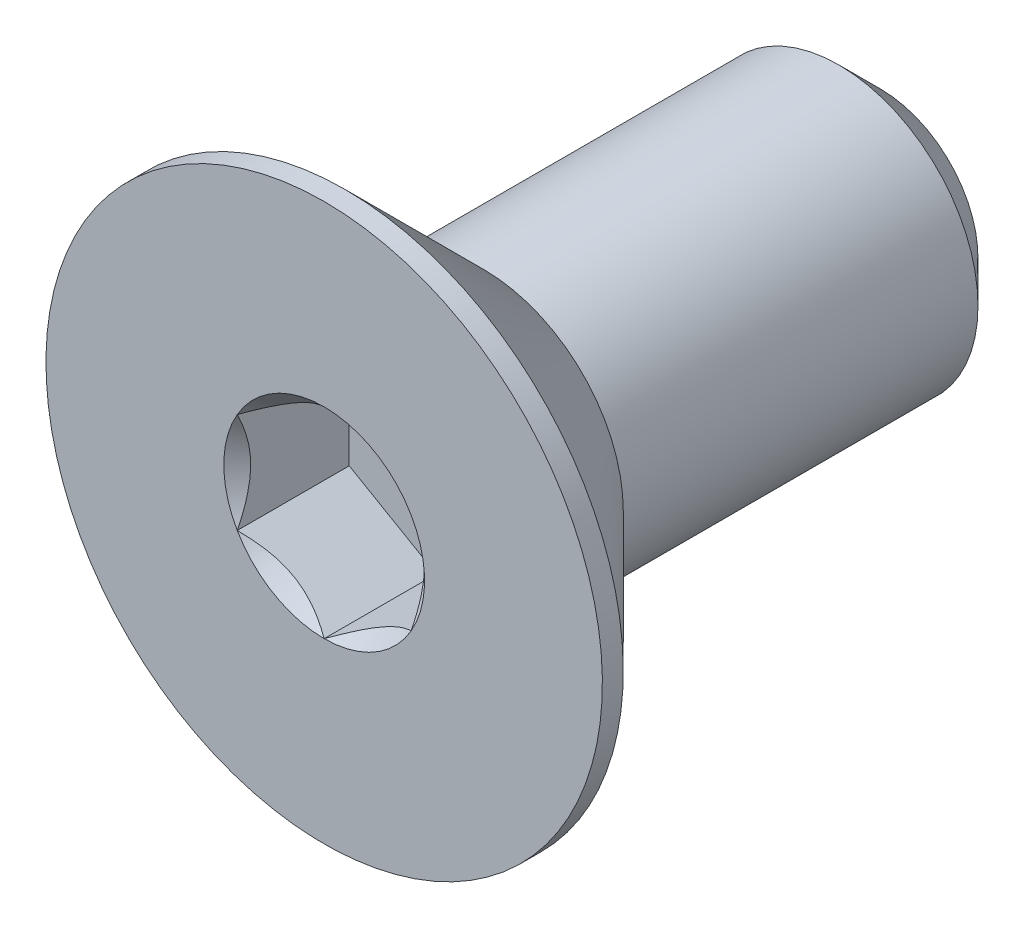
ISO-10303-21;
HEADER;
FILE_DESCRIPTION(('STEP AP214'),'2;1');
FILE_NAME('part.step','',(''),(''),'','','');
FILE_SCHEMA(('AUTOMOTIVE_DESIGN { 1 0 10303 214 1 1 1 1 }'));
ENDSEC;
DATA;
#1=APPLICATION_CONTEXT('core data for automotive mechanical design processes');
#2=APPLICATION_PROTOCOL_DEFINITION('international standard','automotive_design',2000,#1);
#3=PRODUCT_CONTEXT('',#1,'mechanical');
#4=PRODUCT('Part','Part','',(#3));
#5=PRODUCT_RELATED_PRODUCT_CATEGORY('part','',(#4));
#6=PRODUCT_DEFINITION_FORMATION('','',#4);
#7=PRODUCT_DEFINITION_CONTEXT('part definition',#1,'design');
#8=PRODUCT_DEFINITION('design','',#6,#7);
#9=PRODUCT_DEFINITION_SHAPE('','',#8);
#10=(LENGTH_UNIT() NAMED_UNIT(*) SI_UNIT(.MILLI.,.METRE.));
#11=(NAMED_UNIT(*) PLANE_ANGLE_UNIT() SI_UNIT($,.RADIAN.));
#12=(NAMED_UNIT(*) SI_UNIT($,.STERADIAN.) SOLID_ANGLE_UNIT());
#13=UNCERTAINTY_MEASURE_WITH_UNIT(LENGTH_MEASURE(1.E-05),#10,'distance_accuracy_value','');
#14=(GEOMETRIC_REPRESENTATION_CONTEXT(3) GLOBAL_UNCERTAINTY_ASSIGNED_CONTEXT((#13)) GLOBAL_UNIT_ASSIGNED_CONTEXT((#10,
#11,#12)) REPRESENTATION_CONTEXT('',''));
#15=CARTESIAN_POINT('',(0.,0.,0.));
#16=DIRECTION('',(0.,0.,1.));
#17=DIRECTION('',(1.,0.,0.));
#18=AXIS2_PLACEMENT_3D('',#15,#16,#17);
#19=CARTESIAN_POINT('',(0.,0.,-4.));
#20=DIRECTION('',(0.,0.,-1.));
#21=DIRECTION('',(0.,1.,0.));
#22=AXIS2_PLACEMENT_3D('',#19,#20,#21);
#23=CYLINDRICAL_SURFACE('',#22,2.);
#24=CARTESIAN_POINT('',(0.,0.,1.7));
#25=DIRECTION('',(0.,0.,-1.));
#26=DIRECTION('',(0.,1.,0.));
#27=AXIS2_PLACEMENT_3D('',#24,#25,#26);
#28=CIRCLE('',#27,2.);
#29=CARTESIAN_POINT('',(0.,2.,1.7));
#30=VERTEX_POINT('',#29);
#31=EDGE_CURVE('E11',#30,#30,#28,.F.);
#32=ORIENTED_EDGE('',*,*,#31,.F.);
#33=EDGE_LOOP('',(#32));
#34=FACE_BOUND('',#33,.T.);
#35=CARTESIAN_POINT('',(0.,0.,-3.4));
#36=DIRECTION('',(0.,0.,-1.));
#37=DIRECTION('',(0.,1.,0.));
#38=AXIS2_PLACEMENT_3D('',#35,#36,#37);
#39=CIRCLE('',#38,2.);
#40=CARTESIAN_POINT('',(0.,2.,-3.4));
#41=VERTEX_POINT('',#40);
#42=EDGE_CURVE('E43',#41,#41,#39,.F.);
#43=ORIENTED_EDGE('',*,*,#42,.T.);
#44=EDGE_LOOP('',(#43));
#45=FACE_BOUND('',#44,.T.);
#46=ADVANCED_FACE('F35',(#34,#45),#23,.T.);
#47=CARTESIAN_POINT('',(0.,2.,-4.));
#48=DIRECTION('',(0.,0.,-1.));
#49=DIRECTION('',(0.,1.,0.));
#50=AXIS2_PLACEMENT_3D('',#47,#48,#49);
#51=PLANE('',#50);
#52=CARTESIAN_POINT('',(0.,0.,-4.));
#53=DIRECTION('',(0.,0.,-1.));
#54=DIRECTION('',(0.,1.,0.));
#55=AXIS2_PLACEMENT_3D('',#52,#53,#54);
#56=CIRCLE('',#55,1.4);
#57=CARTESIAN_POINT('',(0.,1.4,-4.));
#58=VERTEX_POINT('',#57);
#59=EDGE_CURVE('E147',#58,#58,#56,.T.);
#60=ORIENTED_EDGE('',*,*,#59,.T.);
#61=EDGE_LOOP('',(#60));
#62=FACE_BOUND('',#61,.T.);
#63=ADVANCED_FACE('F156',(#62),#51,.T.);
#64=CARTESIAN_POINT('',(0.,0.,-4.));
#65=DIRECTION('',(0.,0.,1.));
#66=DIRECTION('',(0.,-1.,0.));
#67=AXIS2_PLACEMENT_3D('',#64,#65,#66);
#68=CONICAL_SURFACE('',#67,1.4,0.785398163397446);
#69=ORIENTED_EDGE('',*,*,#42,.F.);
#70=EDGE_LOOP('',(#69));
#71=FACE_BOUND('',#70,.T.);
#72=ORIENTED_EDGE('',*,*,#59,.F.);
#73=EDGE_LOOP('',(#72));
#74=FACE_BOUND('',#73,.T.);
#75=ADVANCED_FACE('F37',(#71,#74),#68,.T.);
#76=CARTESIAN_POINT('',(0.,0.,-4.));
#77=DIRECTION('',(0.,0.,-1.));
#78=DIRECTION('',(0.,1.,0.));
#79=AXIS2_PLACEMENT_3D('',#76,#77,#78);
#80=CYLINDRICAL_SURFACE('',#79,4.);
#81=CARTESIAN_POINT('',(0.,0.,4.));
#82=DIRECTION('',(0.,0.,-1.));
#83=DIRECTION('',(0.,1.,0.));
#84=AXIS2_PLACEMENT_3D('',#81,#82,#83);
#85=CIRCLE('',#84,4.);
#86=CARTESIAN_POINT('',(0.,4.,4.));
#87=VERTEX_POINT('',#86);
#88=EDGE_CURVE('E127',#87,#87,#85,.T.);
#89=ORIENTED_EDGE('',*,*,#88,.T.);
#90=EDGE_LOOP('',(#89));
#91=FACE_BOUND('',#90,.T.);
#92=CARTESIAN_POINT('',(0.,0.,3.69999999999999));
#93=DIRECTION('',(0.,0.,-1.));
#94=DIRECTION('',(0.,1.,0.));
#95=AXIS2_PLACEMENT_3D('',#92,#93,#94);
#96=CIRCLE('',#95,4.);
#97=CARTESIAN_POINT('',(0.,4.,3.69999999999999));
#98=VERTEX_POINT('',#97);
#99=EDGE_CURVE('E124',#98,#98,#96,.T.);
#100=ORIENTED_EDGE('',*,*,#99,.F.);
#101=EDGE_LOOP('',(#100));
#102=FACE_BOUND('',#101,.T.);
#103=ADVANCED_FACE('F155',(#91,#102),#80,.T.);
#104=CARTESIAN_POINT('',(0.,0.,1.7));
#105=DIRECTION('',(0.,0.,1.));
#106=DIRECTION('',(0.,-1.,0.));
#107=AXIS2_PLACEMENT_3D('',#104,#105,#106);
#108=CONICAL_SURFACE('',#107,2.,0.78539816339745);
#109=ORIENTED_EDGE('',*,*,#99,.T.);
#110=EDGE_LOOP('',(#109));
#111=FACE_BOUND('',#110,.T.);
#112=ORIENTED_EDGE('',*,*,#31,.T.);
#113=EDGE_LOOP('',(#112));
#114=FACE_BOUND('',#113,.T.);
#115=ADVANCED_FACE('F169',(#111,#114),#108,.T.);
#116=CARTESIAN_POINT('',(0.,0.,4.));
#117=DIRECTION('',(0.,0.,1.));
#118=DIRECTION('',(0.,-1.,0.));
#119=AXIS2_PLACEMENT_3D('',#116,#117,#118);
#120=PLANE('',#119);
#121=CARTESIAN_POINT('',(0.,0.,4.));
#122=DIRECTION('',(0.,0.,1.));
#123=DIRECTION('',(1.,0.,0.));
#124=AXIS2_PLACEMENT_3D('',#121,#122,#123);
#125=CIRCLE('',#124,1.44337567297406);
#126=CARTESIAN_POINT('',(1.25,0.721687836487038,4.));
#127=VERTEX_POINT('',#126);
#128=CARTESIAN_POINT('',(0.,1.44337567297407,4.));
#129=VERTEX_POINT('',#128);
#130=EDGE_CURVE('E94',#127,#129,#125,.T.);
#131=ORIENTED_EDGE('',*,*,#130,.F.);
#132=CARTESIAN_POINT('',(0.,0.,4.));
#133=DIRECTION('',(0.,0.,1.));
#134=DIRECTION('',(1.,0.,0.));
#135=AXIS2_PLACEMENT_3D('',#132,#133,#134);
#136=CIRCLE('',#135,1.44337567297406);
#137=CARTESIAN_POINT('',(1.24999999999999,-0.721687836487039,4.));
#138=VERTEX_POINT('',#137);
#139=EDGE_CURVE('E106',#138,#127,#136,.T.);
#140=ORIENTED_EDGE('',*,*,#139,.F.);
#141=CARTESIAN_POINT('',(0.,0.,4.));
#142=DIRECTION('',(0.,0.,1.));
#143=DIRECTION('',(1.,0.,0.));
#144=AXIS2_PLACEMENT_3D('',#141,#142,#143);
#145=CIRCLE('',#144,1.44337567297406);
#146=CARTESIAN_POINT('',(0.,-1.44337567297405,4.));
#147=VERTEX_POINT('',#146);
#148=EDGE_CURVE('E240',#147,#138,#145,.T.);
#149=ORIENTED_EDGE('',*,*,#148,.F.);
#150=CARTESIAN_POINT('',(0.,0.,4.));
#151=DIRECTION('',(0.,0.,1.));
#152=DIRECTION('',(1.,0.,0.));
#153=AXIS2_PLACEMENT_3D('',#150,#151,#152);
#154=CIRCLE('',#153,1.44337567297406);
#155=CARTESIAN_POINT('',(-1.25,-0.72168783648702,4.));
#156=VERTEX_POINT('',#155);
#157=EDGE_CURVE('E119',#156,#147,#154,.T.);
#158=ORIENTED_EDGE('',*,*,#157,.F.);
#159=CARTESIAN_POINT('',(0.,0.,4.));
#160=DIRECTION('',(0.,0.,1.));
#161=DIRECTION('',(1.,0.,0.));
#162=AXIS2_PLACEMENT_3D('',#159,#160,#161);
#163=CIRCLE('',#162,1.44337567297406);
#164=CARTESIAN_POINT('',(-1.25,0.72168783648703,4.));
#165=VERTEX_POINT('',#164);
#166=EDGE_CURVE('E241',#165,#156,#163,.T.);
#167=ORIENTED_EDGE('',*,*,#166,.F.);
#168=CARTESIAN_POINT('',(0.,0.,4.));
#169=DIRECTION('',(0.,0.,1.));
#170=DIRECTION('',(1.,0.,0.));
#171=AXIS2_PLACEMENT_3D('',#168,#169,#170);
#172=CIRCLE('',#171,1.44337567297406);
#173=EDGE_CURVE('E109',#129,#165,#172,.T.);
#174=ORIENTED_EDGE('',*,*,#173,.F.);
#175=EDGE_LOOP('',(#131,#140,#149,#158,#167,#174));
#176=FACE_BOUND('',#175,.T.);
#177=ORIENTED_EDGE('',*,*,#88,.F.);
#178=EDGE_LOOP('',(#177));
#179=FACE_BOUND('',#178,.T.);
#180=ADVANCED_FACE('F103',(#176,#179),#120,.T.);
#181=CARTESIAN_POINT('',(1.25,0.721687836487033,2.39));
#182=DIRECTION('',(0.5,0.866025403784439,0.));
#183=DIRECTION('',(-0.866025403784439,0.5,0.));
#184=AXIS2_PLACEMENT_3D('',#181,#182,#183);
#185=PLANE('',#184);
#186=DIRECTION('',(0.,0.,1.));
#187=VECTOR('',#186,1.);
#188=CARTESIAN_POINT('',(1.25,0.721687836487033,2.39));
#189=LINE('',#188,#187);
#190=CARTESIAN_POINT('',(1.25,0.721687836487033,2.39));
#191=VERTEX_POINT('',#190);
#192=EDGE_CURVE('E50',#191,#127,#189,.T.);
#193=ORIENTED_EDGE('',*,*,#192,.T.);
#194=CARTESIAN_POINT('',(-0.000199999999999663,1.4434911430279,4.00011548390913));
#195=CARTESIAN_POINT('',(0.0427751670715869,1.41867941875065,3.9753216680551));
#196=CARTESIAN_POINT('',(0.0864690047459478,1.39345276980743,3.95198373441868));
#197=CARTESIAN_POINT('',(0.175565930841941,1.34201263554194,3.90925200408453));
#198=CARTESIAN_POINT('',(0.220977498357063,1.31579425481277,3.88988199236041));
#199=CARTESIAN_POINT('',(0.312547820935258,1.26292610442246,3.85670048341347));
#200=CARTESIAN_POINT('',(0.358683240175883,1.23628980770471,3.84280555905265));
#201=CARTESIAN_POINT('',(0.45197008040759,1.18243062538509,3.82139728216063));
#202=CARTESIAN_POINT('',(0.499118649136376,1.15520938653762,3.81386794156678));
#203=CARTESIAN_POINT('',(0.580373556887249,1.10829684367467,3.8070744980507));
#204=CARTESIAN_POINT('',(0.614374876627937,1.08866617256958,3.80606855910434));
#205=CARTESIAN_POINT('',(0.682317764432473,1.04943932800611,3.80776141491131));
#206=CARTESIAN_POINT('',(0.716259317655653,1.029843163116,3.81046102721553));
#207=CARTESIAN_POINT('',(0.783814856457495,0.990839954603503,3.81940893031637));
#208=CARTESIAN_POINT('',(0.81742850728677,0.971433104248775,3.8256605258997));
#209=CARTESIAN_POINT('',(0.884094638217807,0.932943395609909,3.8413756814139));
#210=CARTESIAN_POINT('',(0.91714687103029,0.913860680098304,3.85084062008745));
#211=CARTESIAN_POINT('',(1.00179969160026,0.864986351354571,3.87893139068758));
#212=CARTESIAN_POINT('',(1.05286649242963,0.835502920149079,3.89967015745219));
#213=CARTESIAN_POINT('',(1.15300085411325,0.77769031947591,3.94638713467147));
#214=CARTESIAN_POINT('',(1.20207431157827,0.749357745598418,3.97234829594676));
#215=CARTESIAN_POINT('',(1.2502,0.721572366433195,4.00011548390913));
#216=B_SPLINE_CURVE_WITH_KNOTS('',3,(#194,#195,#196,#197,#198,#199,#200,#201,#202,#203,#204,
#205,#206,#207,#208,#209,#210,#211,#212,#213,#214,#215),.UNSPECIFIED.,.F.,.F.,(4,2,2,2,2,2,2,2,
2,2,4),(0.,0.166533409618302,0.334037607289759,0.498880396489694,0.66330791924027,
0.780963963458821,0.898645970148447,1.01643764860773,1.13427993171549,1.3214865203214,
1.50809158792574),.UNSPECIFIED.);
#217=EDGE_CURVE('E91',#129,#127,#216,.T.);
#218=ORIENTED_EDGE('',*,*,#217,.F.);
#219=DIRECTION('',(0.,0.,1.));
#220=VECTOR('',#219,1.);
#221=CARTESIAN_POINT('',(0.,1.44337567297406,2.39));
#222=LINE('',#221,#220);
#223=CARTESIAN_POINT('',(0.,1.44337567297406,2.39));
#224=VERTEX_POINT('',#223);
#225=EDGE_CURVE('E143',#224,#129,#222,.T.);
#226=ORIENTED_EDGE('',*,*,#225,.F.);
#227=DIRECTION('',(-0.866025403784439,0.5,0.));
#228=VECTOR('',#227,1.);
#229=CARTESIAN_POINT('',(1.25,0.721687836487033,2.39));
#230=LINE('',#229,#228);
#231=EDGE_CURVE('E116',#191,#224,#230,.T.);
#232=ORIENTED_EDGE('',*,*,#231,.F.);
#233=EDGE_LOOP('',(#193,#218,#226,#232));
#234=FACE_BOUND('',#233,.T.);
#235=ADVANCED_FACE('F121',(#234),#185,.F.);
#236=CARTESIAN_POINT('',(1.25,-0.721687836487033,2.39));
#237=DIRECTION('',(1.,0.,0.));
#238=DIRECTION('',(0.,1.,0.));
#239=AXIS2_PLACEMENT_3D('',#236,#237,#238);
#240=PLANE('',#239);
#241=DIRECTION('',(0.,0.,1.));
#242=VECTOR('',#241,1.);
#243=CARTESIAN_POINT('',(1.25,-0.721687836487033,2.39));
#244=LINE('',#243,#242);
#245=CARTESIAN_POINT('',(1.25,-0.721687836487033,2.39));
#246=VERTEX_POINT('',#245);
#247=EDGE_CURVE('E58',#246,#138,#244,.T.);
#248=ORIENTED_EDGE('',*,*,#247,.T.);
#249=CARTESIAN_POINT('',(1.25,-1.43934010808078,4.46298209689234));
#250=CARTESIAN_POINT('',(1.25,-1.40429313005659,4.4365249226329));
#251=CARTESIAN_POINT('',(1.25,-1.369050871356,4.41032716035429));
#252=CARTESIAN_POINT('',(1.25,-1.29809650706311,4.3585575718396));
#253=CARTESIAN_POINT('',(1.25,-1.26238428576496,4.33298590435631));
#254=CARTESIAN_POINT('',(1.25,-1.15390111792708,4.25700599368947));
#255=CARTESIAN_POINT('',(1.25,-1.08031646726265,4.20774028618958));
#256=CARTESIAN_POINT('',(1.25,-0.926012322755098,4.11102583026314));
#257=CARTESIAN_POINT('',(1.25,-0.845125318656149,4.0638412989418));
#258=CARTESIAN_POINT('',(1.25,-0.679311174076603,3.97753073439042));
#259=CARTESIAN_POINT('',(1.25,-0.594398891026687,3.9383775346269));
#260=CARTESIAN_POINT('',(1.25,-0.466944812460739,3.8904772236883));
#261=CARTESIAN_POINT('',(1.25,-0.42628998581282,3.87672948978634));
#262=CARTESIAN_POINT('',(1.25,-0.343998850091265,3.85249792745054));
#263=CARTESIAN_POINT('',(1.25,-0.30236247361496,3.84201432386977));
#264=CARTESIAN_POINT('',(1.25,-0.219052696285662,3.8250301617483));
#265=CARTESIAN_POINT('',(1.25,-0.177393428474497,3.81846136047137));
#266=CARTESIAN_POINT('',(1.25,-0.0936293693401885,3.80943505345776));
#267=CARTESIAN_POINT('',(1.25,-0.0515246558543921,3.80697684099727));
#268=CARTESIAN_POINT('',(1.25,0.031189057630636,3.80635406201329));
#269=CARTESIAN_POINT('',(1.25,0.071796962549935,3.80803711684625));
#270=CARTESIAN_POINT('',(1.25,0.152668636885202,3.81526827059791));
#271=CARTESIAN_POINT('',(1.25,0.192932338835363,3.82081711041311));
#272=CARTESIAN_POINT('',(1.25,0.273499879165301,3.83557103646495));
#273=CARTESIAN_POINT('',(1.25,0.313792180618517,3.84483817596411));
#274=CARTESIAN_POINT('',(1.25,0.393496413911464,3.86653617845735));
#275=CARTESIAN_POINT('',(1.25,0.432908419115066,3.87896677673065));
#276=CARTESIAN_POINT('',(1.25,0.556992735862305,3.92277935293144));
#277=CARTESIAN_POINT('',(1.25,0.639898924666092,3.95915107287596));
#278=CARTESIAN_POINT('',(1.25,0.801816555499707,4.04001916217833));
#279=CARTESIAN_POINT('',(1.25,0.88081266632505,4.08454472091199));
#280=CARTESIAN_POINT('',(1.25,1.0317856127975,4.17640487666662));
#281=CARTESIAN_POINT('',(1.25,1.10391618485086,4.22348993391625));
#282=CARTESIAN_POINT('',(1.25,1.21018606043311,4.29627856159854));
#283=CARTESIAN_POINT('',(1.25,1.2451506996938,4.32079808539336));
#284=CARTESIAN_POINT('',(1.25,1.31460220852737,4.37048563676568));
#285=CARTESIAN_POINT('',(1.25,1.34908920596618,4.39565348541552));
#286=CARTESIAN_POINT('',(1.25,1.38337731682912,4.42109014884121));
#287=B_SPLINE_CURVE_WITH_KNOTS('',3,(#249,#250,#251,#252,#253,#254,#255,#256,#257,#258,#259,
#260,#261,#262,#263,#264,#265,#266,#267,#268,#269,#270,#271,#272,#273,#274,#275,#276,#277,#278,
#279,#280,#281,#282,#283,#284,#285,#286),.UNSPECIFIED.,.F.,.F.,(4,2,2,2,2,2,2,2,2,2,2,2,2,2,2,2,
2,2,4),(0.,0.131732960381449,0.263498984161647,0.529042014455831,0.809741926134627,
1.08947609717226,1.21811634272578,1.34676544783902,1.47310084517845,1.59941451973786,
1.72115042167851,1.84290966131737,1.96679153905343,2.09066305366041,2.36146692896011,
2.63325989198493,2.89154668212281,3.01965734507714,3.1477330224563),.UNSPECIFIED.);
#288=EDGE_CURVE('E115',#127,#138,#287,.F.);
#289=ORIENTED_EDGE('',*,*,#288,.F.);
#290=ORIENTED_EDGE('',*,*,#192,.F.);
#291=DIRECTION('',(0.,1.,0.));
#292=VECTOR('',#291,1.);
#293=CARTESIAN_POINT('',(1.25,-0.721687836487033,2.39));
#294=LINE('',#293,#292);
#295=EDGE_CURVE('E132',#246,#191,#294,.T.);
#296=ORIENTED_EDGE('',*,*,#295,.F.);
#297=EDGE_LOOP('',(#248,#289,#290,#296));
#298=FACE_BOUND('',#297,.T.);
#299=ADVANCED_FACE('F118',(#298),#240,.F.);
#300=CARTESIAN_POINT('',(0.,-1.44337567297406,2.39));
#301=DIRECTION('',(0.5,-0.866025403784439,0.));
#302=DIRECTION('',(0.866025403784439,0.5,0.));
#303=AXIS2_PLACEMENT_3D('',#300,#301,#302);
#304=PLANE('',#303);
#305=DIRECTION('',(0.,0.,1.));
#306=VECTOR('',#305,1.);
#307=CARTESIAN_POINT('',(0.,-1.44337567297406,2.39));
#308=LINE('',#307,#306);
#309=CARTESIAN_POINT('',(0.,-1.44337567297406,2.39));
#310=VERTEX_POINT('',#309);
#311=EDGE_CURVE('E129',#310,#147,#308,.T.);
#312=ORIENTED_EDGE('',*,*,#311,.T.);
#313=CARTESIAN_POINT('',(1.2502,-0.721572366433196,4.00011548390914));
#314=CARTESIAN_POINT('',(1.20722483292841,-0.746384090710445,3.97532166805511));
#315=CARTESIAN_POINT('',(1.16353099525405,-0.771610739653665,3.95198373441869));
#316=CARTESIAN_POINT('',(1.07443406915806,-0.823050873919155,3.90925200408454));
#317=CARTESIAN_POINT('',(1.02902250164294,-0.849269254648333,3.88988199236042));
#318=CARTESIAN_POINT('',(0.937452179064742,-0.902137405038635,3.85670048341349));
#319=CARTESIAN_POINT('',(0.891316759824116,-0.928773701756387,3.84280555905266));
#320=CARTESIAN_POINT('',(0.79802991959241,-0.982632884076012,3.82139728216065));
#321=CARTESIAN_POINT('',(0.750881350863623,-1.00985412292348,3.8138679415668));
#322=CARTESIAN_POINT('',(0.669626443112751,-1.05676666578643,3.80707449805071));
#323=CARTESIAN_POINT('',(0.635625123372062,-1.07639733689152,3.80606855910436));
#324=CARTESIAN_POINT('',(0.567682235567525,-1.11562418145499,3.80776141491133));
#325=CARTESIAN_POINT('',(0.533740682344345,-1.1352203463451,3.81046102721555));
#326=CARTESIAN_POINT('',(0.466185143542503,-1.1742235548576,3.81940893031639));
#327=CARTESIAN_POINT('',(0.432571492713227,-1.19363040521232,3.82566052589971));
#328=CARTESIAN_POINT('',(0.365905361782189,-1.23212011385119,3.84137568141391));
#329=CARTESIAN_POINT('',(0.332853128969706,-1.2512028293628,3.85084062008747));
#330=CARTESIAN_POINT('',(0.248200308399737,-1.30007715810653,3.8789313906876));
#331=CARTESIAN_POINT('',(0.197133507570363,-1.32956058931202,3.89967015745221));
#332=CARTESIAN_POINT('',(0.0969991458867458,-1.38737318998519,3.94638713467149));
#333=CARTESIAN_POINT('',(0.0479256884217309,-1.41570576386268,3.97234829594678));
#334=CARTESIAN_POINT('',(-0.000200000000000069,-1.4434911430279,4.00011548390915));
#335=B_SPLINE_CURVE_WITH_KNOTS('',3,(#313,#314,#315,#316,#317,#318,#319,#320,#321,#322,#323,
#324,#325,#326,#327,#328,#329,#330,#331,#332,#333,#334),.UNSPECIFIED.,.F.,.F.,(4,2,2,2,2,2,2,2,
2,2,4),(0.,0.166533409618302,0.334037607289759,0.498880396489693,0.663307919240268,
0.780963963458821,0.898645970148448,1.01643764860773,1.13427993171549,1.32148652032141,
1.50809158792573),.UNSPECIFIED.);
#336=EDGE_CURVE('E238',#138,#147,#335,.T.);
#337=ORIENTED_EDGE('',*,*,#336,.F.);
#338=ORIENTED_EDGE('',*,*,#247,.F.);
#339=DIRECTION('',(0.866025403784439,0.5,0.));
#340=VECTOR('',#339,1.);
#341=CARTESIAN_POINT('',(0.,-1.44337567297406,2.39));
#342=LINE('',#341,#340);
#343=EDGE_CURVE('E230',#310,#246,#342,.T.);
#344=ORIENTED_EDGE('',*,*,#343,.F.);
#345=EDGE_LOOP('',(#312,#337,#338,#344));
#346=FACE_BOUND('',#345,.T.);
#347=ADVANCED_FACE('F195',(#346),#304,.F.);
#348=CARTESIAN_POINT('',(-1.25,-0.721687836487032,2.39));
#349=DIRECTION('',(-0.5,-0.866025403784438,0.));
#350=DIRECTION('',(0.866025403784439,-0.5,0.));
#351=AXIS2_PLACEMENT_3D('',#348,#349,#350);
#352=PLANE('',#351);
#353=DIRECTION('',(0.,0.,1.));
#354=VECTOR('',#353,1.);
#355=CARTESIAN_POINT('',(-1.25,-0.721687836487032,2.39));
#356=LINE('',#355,#354);
#357=CARTESIAN_POINT('',(-1.25,-0.721687836487032,2.39));
#358=VERTEX_POINT('',#357);
#359=EDGE_CURVE('E137',#358,#156,#356,.T.);
#360=ORIENTED_EDGE('',*,*,#359,.T.);
#361=CARTESIAN_POINT('',(0.000199999999999953,-1.4434911430279,4.00011548390915));
#362=CARTESIAN_POINT('',(-0.0427751670715869,-1.41867941875065,3.97532166805511));
#363=CARTESIAN_POINT('',(-0.0864690047459483,-1.39345276980743,3.95198373441869));
#364=CARTESIAN_POINT('',(-0.175565930841943,-1.34201263554194,3.90925200408455));
#365=CARTESIAN_POINT('',(-0.220977498357065,-1.31579425481276,3.88988199236042));
#366=CARTESIAN_POINT('',(-0.312547820935262,-1.26292610442246,3.85670048341349));
#367=CARTESIAN_POINT('',(-0.358683240175888,-1.23628980770471,3.84280555905267));
#368=CARTESIAN_POINT('',(-0.451970080407595,-1.18243062538508,3.82139728216065));
#369=CARTESIAN_POINT('',(-0.499118649136383,-1.15520938653761,3.8138679415668));
#370=CARTESIAN_POINT('',(-0.580373556887256,-1.10829684367467,3.80707449805071));
#371=CARTESIAN_POINT('',(-0.614374876627945,-1.08866617256958,3.80606855910436));
#372=CARTESIAN_POINT('',(-0.682317764432481,-1.04943932800611,3.80776141491133));
#373=CARTESIAN_POINT('',(-0.716259317655662,-1.02984316311599,3.81046102721555));
#374=CARTESIAN_POINT('',(-0.783814856457504,-0.990839954603497,3.81940893031639));
#375=CARTESIAN_POINT('',(-0.81742850728678,-0.971433104248769,3.82566052589971));
#376=CARTESIAN_POINT('',(-0.884094638217818,-0.932943395609903,3.84137568141391));
#377=CARTESIAN_POINT('',(-0.917146871030301,-0.913860680098298,3.85084062008747));
#378=CARTESIAN_POINT('',(-1.00179969160027,-0.864986351354565,3.8789313906876));
#379=CARTESIAN_POINT('',(-1.05286649242964,-0.835502920149074,3.89967015745221));
#380=CARTESIAN_POINT('',(-1.15300085411326,-0.777690319475907,3.94638713467148));
#381=CARTESIAN_POINT('',(-1.20207431157827,-0.749357745598416,3.97234829594677));
#382=CARTESIAN_POINT('',(-1.2502,-0.721572366433195,4.00011548390914));
#383=B_SPLINE_CURVE_WITH_KNOTS('',3,(#361,#362,#363,#364,#365,#366,#367,#368,#369,#370,#371,
#372,#373,#374,#375,#376,#377,#378,#379,#380,#381,#382),.UNSPECIFIED.,.F.,.F.,(4,2,2,2,2,2,2,2,
2,2,4),(0.,0.166533409618304,0.334037607289764,0.498880396489701,0.663307919240278,
0.780963963458831,0.898645970148458,1.01643764860774,1.1342799317155,1.32148652032141,
1.50809158792573),.UNSPECIFIED.);
#384=EDGE_CURVE('E212',#147,#156,#383,.T.);
#385=ORIENTED_EDGE('',*,*,#384,.F.);
#386=ORIENTED_EDGE('',*,*,#311,.F.);
#387=DIRECTION('',(0.866025403784438,-0.5,0.));
#388=VECTOR('',#387,1.);
#389=CARTESIAN_POINT('',(-1.25,-0.721687836487032,2.39));
#390=LINE('',#389,#388);
#391=EDGE_CURVE('E228',#358,#310,#390,.T.);
#392=ORIENTED_EDGE('',*,*,#391,.F.);
#393=EDGE_LOOP('',(#360,#385,#386,#392));
#394=FACE_BOUND('',#393,.T.);
#395=ADVANCED_FACE('F191',(#394),#352,.F.);
#396=CARTESIAN_POINT('',(-1.25,0.721687836487033,2.39));
#397=DIRECTION('',(-1.,0.,0.));
#398=DIRECTION('',(0.,0.,1.));
#399=AXIS2_PLACEMENT_3D('',#396,#397,#398);
#400=PLANE('',#399);
#401=DIRECTION('',(0.,0.,1.));
#402=VECTOR('',#401,1.);
#403=CARTESIAN_POINT('',(-1.25,0.721687836487033,2.39));
#404=LINE('',#403,#402);
#405=CARTESIAN_POINT('',(-1.25,0.721687836487033,2.39));
#406=VERTEX_POINT('',#405);
#407=EDGE_CURVE('E140',#406,#165,#404,.T.);
#408=ORIENTED_EDGE('',*,*,#407,.T.);
#409=CARTESIAN_POINT('',(-1.25,-1.43934010808078,4.46298209689234));
#410=CARTESIAN_POINT('',(-1.25,-1.40429313005659,4.4365249226329));
#411=CARTESIAN_POINT('',(-1.25,-1.369050871356,4.41032716035429));
#412=CARTESIAN_POINT('',(-1.25,-1.29809650706311,4.3585575718396));
#413=CARTESIAN_POINT('',(-1.25,-1.26238428576496,4.33298590435631));
#414=CARTESIAN_POINT('',(-1.25,-1.15390111792708,4.25700599368948));
#415=CARTESIAN_POINT('',(-1.25,-1.08031646726265,4.20774028618958));
#416=CARTESIAN_POINT('',(-1.25,-0.926012322755097,4.11102583026314));
#417=CARTESIAN_POINT('',(-1.25,-0.845125318656148,4.0638412989418));
#418=CARTESIAN_POINT('',(-1.25,-0.679311174076602,3.97753073439042));
#419=CARTESIAN_POINT('',(-1.25,-0.594398891026686,3.9383775346269));
#420=CARTESIAN_POINT('',(-1.25,-0.466944812460738,3.8904772236883));
#421=CARTESIAN_POINT('',(-1.25,-0.426289985812819,3.87672948978634));
#422=CARTESIAN_POINT('',(-1.25,-0.343998850091264,3.85249792745055));
#423=CARTESIAN_POINT('',(-1.25,-0.302362473614959,3.84201432386978));
#424=CARTESIAN_POINT('',(-1.25,-0.219052696285662,3.8250301617483));
#425=CARTESIAN_POINT('',(-1.25,-0.177393428474496,3.81846136047137));
#426=CARTESIAN_POINT('',(-1.25,-0.0936293693401875,3.80943505345776));
#427=CARTESIAN_POINT('',(-1.25,-0.0515246558543911,3.80697684099727));
#428=CARTESIAN_POINT('',(-1.25,0.031189057630637,3.80635406201329));
#429=CARTESIAN_POINT('',(-1.25,0.071796962549936,3.80803711684625));
#430=CARTESIAN_POINT('',(-1.25,0.152668636885203,3.81526827059791));
#431=CARTESIAN_POINT('',(-1.25,0.192932338835364,3.82081711041311));
#432=CARTESIAN_POINT('',(-1.25,0.273499879165302,3.83557103646495));
#433=CARTESIAN_POINT('',(-1.25,0.313792180618518,3.84483817596411));
#434=CARTESIAN_POINT('',(-1.25,0.393496413911465,3.86653617845735));
#435=CARTESIAN_POINT('',(-1.25,0.432908419115067,3.87896677673065));
#436=CARTESIAN_POINT('',(-1.25,0.556992735862306,3.92277935293144));
#437=CARTESIAN_POINT('',(-1.25,0.639898924666093,3.95915107287596));
#438=CARTESIAN_POINT('',(-1.25,0.801816555499708,4.04001916217833));
#439=CARTESIAN_POINT('',(-1.25,0.880812666325051,4.08454472091199));
#440=CARTESIAN_POINT('',(-1.25,1.0317856127975,4.17640487666662));
#441=CARTESIAN_POINT('',(-1.25,1.10391618485086,4.22348993391625));
#442=CARTESIAN_POINT('',(-1.25,1.21018606043311,4.29627856159854));
#443=CARTESIAN_POINT('',(-1.25,1.2451506996938,4.32079808539336));
#444=CARTESIAN_POINT('',(-1.25,1.31460220852737,4.37048563676568));
#445=CARTESIAN_POINT('',(-1.25,1.34908920596618,4.39565348541552));
#446=CARTESIAN_POINT('',(-1.25,1.38337731682912,4.42109014884121));
#447=B_SPLINE_CURVE_WITH_KNOTS('',3,(#409,#410,#411,#412,#413,#414,#415,#416,#417,#418,#419,
#420,#421,#422,#423,#424,#425,#426,#427,#428,#429,#430,#431,#432,#433,#434,#435,#436,#437,#438,
#439,#440,#441,#442,#443,#444,#445,#446),.UNSPECIFIED.,.F.,.F.,(4,2,2,2,2,2,2,2,2,2,2,2,2,2,2,2,
2,2,4),(0.,0.131732960381449,0.263498984161647,0.52904201445583,0.809741926134626,
1.08947609717226,1.21811634272578,1.34676544783902,1.47310084517845,1.59941451973786,
1.72115042167851,1.84290966131736,1.96679153905343,2.09066305366041,2.36146692896011,
2.63325989198493,2.89154668212281,3.01965734507714,3.14773302245629),.UNSPECIFIED.);
#448=EDGE_CURVE('E97',#156,#165,#447,.T.);
#449=ORIENTED_EDGE('',*,*,#448,.F.);
#450=ORIENTED_EDGE('',*,*,#359,.F.);
#451=DIRECTION('',(0.,-1.,0.));
#452=VECTOR('',#451,1.);
#453=CARTESIAN_POINT('',(-1.25,0.721687836487033,2.39));
#454=LINE('',#453,#452);
#455=EDGE_CURVE('E225',#406,#358,#454,.T.);
#456=ORIENTED_EDGE('',*,*,#455,.F.);
#457=EDGE_LOOP('',(#408,#449,#450,#456));
#458=FACE_BOUND('',#457,.T.);
#459=ADVANCED_FACE('F187',(#458),#400,.F.);
#460=CARTESIAN_POINT('',(0.,1.44337567297406,2.39));
#461=DIRECTION('',(-0.5,0.866025403784439,0.));
#462=DIRECTION('',(-0.866025403784439,-0.5,0.));
#463=AXIS2_PLACEMENT_3D('',#460,#461,#462);
#464=PLANE('',#463);
#465=ORIENTED_EDGE('',*,*,#225,.T.);
#466=CARTESIAN_POINT('',(-1.2502,0.721572366433195,4.00011548390913));
#467=CARTESIAN_POINT('',(-1.20722483292841,0.746384090710444,3.9753216680551));
#468=CARTESIAN_POINT('',(-1.16353099525405,0.771610739653665,3.95198373441868));
#469=CARTESIAN_POINT('',(-1.07443406915806,0.823050873919155,3.90925200408453));
#470=CARTESIAN_POINT('',(-1.02902250164294,0.849269254648334,3.88988199236041));
#471=CARTESIAN_POINT('',(-0.937452179064739,0.902137405038636,3.85670048341347));
#472=CARTESIAN_POINT('',(-0.891316759824113,0.928773701756388,3.84280555905265));
#473=CARTESIAN_POINT('',(-0.798029919592406,0.982632884076014,3.82139728216063));
#474=CARTESIAN_POINT('',(-0.750881350863619,1.00985412292349,3.81386794156678));
#475=CARTESIAN_POINT('',(-0.669626443112746,1.05676666578643,3.8070744980507));
#476=CARTESIAN_POINT('',(-0.635625123372057,1.07639733689152,3.80606855910434));
#477=CARTESIAN_POINT('',(-0.567682235567521,1.11562418145499,3.80776141491131));
#478=CARTESIAN_POINT('',(-0.533740682344341,1.1352203463451,3.81046102721553));
#479=CARTESIAN_POINT('',(-0.4661851435425,1.1742235548576,3.81940893031637));
#480=CARTESIAN_POINT('',(-0.432571492713225,1.19363040521233,3.8256605258997));
#481=CARTESIAN_POINT('',(-0.365905361782187,1.23212011385119,3.8413756814139));
#482=CARTESIAN_POINT('',(-0.332853128969704,1.2512028293628,3.85084062008745));
#483=CARTESIAN_POINT('',(-0.248200308399736,1.30007715810653,3.87893139068758));
#484=CARTESIAN_POINT('',(-0.197133507570362,1.32956058931202,3.89967015745219));
#485=CARTESIAN_POINT('',(-0.0969991458867449,1.38737318998519,3.94638713467147));
#486=CARTESIAN_POINT('',(-0.0479256884217303,1.41570576386268,3.97234829594676));
#487=CARTESIAN_POINT('',(0.000200000000000133,1.4434911430279,4.00011548390913));
#488=B_SPLINE_CURVE_WITH_KNOTS('',3,(#466,#467,#468,#469,#470,#471,#472,#473,#474,#475,#476,
#477,#478,#479,#480,#481,#482,#483,#484,#485,#486,#487),.UNSPECIFIED.,.F.,.F.,(4,2,2,2,2,2,2,2,
2,2,4),(0.,0.166533409618304,0.334037607289764,0.498880396489701,0.663307919240278,
0.780963963458829,0.898645970148455,1.01643764860773,1.1342799317155,1.32148652032141,
1.50809158792574),.UNSPECIFIED.);
#489=EDGE_CURVE('E234',#165,#129,#488,.T.);
#490=ORIENTED_EDGE('',*,*,#489,.F.);
#491=ORIENTED_EDGE('',*,*,#407,.F.);
#492=DIRECTION('',(-0.866025403784439,-0.5,0.));
#493=VECTOR('',#492,1.);
#494=CARTESIAN_POINT('',(0.,1.44337567297406,2.39));
#495=LINE('',#494,#493);
#496=EDGE_CURVE('E222',#224,#406,#495,.T.);
#497=ORIENTED_EDGE('',*,*,#496,.F.);
#498=EDGE_LOOP('',(#465,#490,#491,#497));
#499=FACE_BOUND('',#498,.T.);
#500=ADVANCED_FACE('F183',(#499),#464,.F.);
#501=CARTESIAN_POINT('',(0.,0.,2.39));
#502=DIRECTION('',(0.,0.,1.));
#503=DIRECTION('',(1.,0.,0.));
#504=AXIS2_PLACEMENT_3D('',#501,#502,#503);
#505=PLANE('',#504);
#506=ORIENTED_EDGE('',*,*,#231,.T.);
#507=ORIENTED_EDGE('',*,*,#496,.T.);
#508=ORIENTED_EDGE('',*,*,#455,.T.);
#509=ORIENTED_EDGE('',*,*,#391,.T.);
#510=ORIENTED_EDGE('',*,*,#343,.T.);
#511=ORIENTED_EDGE('',*,*,#295,.T.);
#512=EDGE_LOOP('',(#506,#507,#508,#509,#510,#511));
#513=FACE_BOUND('',#512,.T.);
#514=ADVANCED_FACE('F186',(#513),#505,.T.);
#515=CARTESIAN_POINT('',(0.,0.,4.));
#516=DIRECTION('',(0.,0.,1.));
#517=DIRECTION('',(1.,0.,0.));
#518=AXIS2_PLACEMENT_3D('',#515,#516,#517);
#519=CONICAL_SURFACE('',#518,1.44337567297406,0.78539816339745);
#520=ORIENTED_EDGE('',*,*,#489,.T.);
#521=ORIENTED_EDGE('',*,*,#173,.T.);
#522=EDGE_LOOP('',(#520,#521));
#523=FACE_BOUND('',#522,.T.);
#524=ADVANCED_FACE('F202',(#523),#519,.F.);
#525=CARTESIAN_POINT('',(0.,0.,4.));
#526=DIRECTION('',(0.,0.,1.));
#527=DIRECTION('',(1.,0.,0.));
#528=AXIS2_PLACEMENT_3D('',#525,#526,#527);
#529=CONICAL_SURFACE('',#528,1.44337567297406,0.78539816339745);
#530=ORIENTED_EDGE('',*,*,#384,.T.);
#531=ORIENTED_EDGE('',*,*,#157,.T.);
#532=EDGE_LOOP('',(#530,#531));
#533=FACE_BOUND('',#532,.T.);
#534=ADVANCED_FACE('F204',(#533),#529,.F.);
#535=CARTESIAN_POINT('',(0.,0.,4.));
#536=DIRECTION('',(0.,0.,1.));
#537=DIRECTION('',(1.,0.,0.));
#538=AXIS2_PLACEMENT_3D('',#535,#536,#537);
#539=CONICAL_SURFACE('',#538,1.44337567297406,0.78539816339745);
#540=ORIENTED_EDGE('',*,*,#288,.T.);
#541=ORIENTED_EDGE('',*,*,#139,.T.);
#542=EDGE_LOOP('',(#540,#541));
#543=FACE_BOUND('',#542,.T.);
#544=ADVANCED_FACE('F114',(#543),#539,.F.);
#545=CARTESIAN_POINT('',(0.,0.,4.));
#546=DIRECTION('',(0.,0.,1.));
#547=DIRECTION('',(1.,0.,0.));
#548=AXIS2_PLACEMENT_3D('',#545,#546,#547);
#549=CONICAL_SURFACE('',#548,1.44337567297406,0.78539816339745);
#550=ORIENTED_EDGE('',*,*,#336,.T.);
#551=ORIENTED_EDGE('',*,*,#148,.T.);
#552=EDGE_LOOP('',(#550,#551));
#553=FACE_BOUND('',#552,.T.);
#554=ADVANCED_FACE('F253',(#553),#549,.F.);
#555=CARTESIAN_POINT('',(0.,0.,4.));
#556=DIRECTION('',(0.,0.,1.));
#557=DIRECTION('',(1.,0.,0.));
#558=AXIS2_PLACEMENT_3D('',#555,#556,#557);
#559=CONICAL_SURFACE('',#558,1.44337567297406,0.78539816339745);
#560=ORIENTED_EDGE('',*,*,#448,.T.);
#561=ORIENTED_EDGE('',*,*,#166,.T.);
#562=EDGE_LOOP('',(#560,#561));
#563=FACE_BOUND('',#562,.T.);
#564=ADVANCED_FACE('F258',(#563),#559,.F.);
#565=CARTESIAN_POINT('',(0.,0.,4.));
#566=DIRECTION('',(0.,0.,1.));
#567=DIRECTION('',(1.,0.,0.));
#568=AXIS2_PLACEMENT_3D('',#565,#566,#567);
#569=CONICAL_SURFACE('',#568,1.44337567297406,0.78539816339745);
#570=ORIENTED_EDGE('',*,*,#217,.T.);
#571=ORIENTED_EDGE('',*,*,#130,.T.);
#572=EDGE_LOOP('',(#570,#571));
#573=FACE_BOUND('',#572,.T.);
#574=ADVANCED_FACE('F93',(#573),#569,.F.);
#575=CLOSED_SHELL('',(#46,#63,#75,#103,#115,#180,#235,#299,#347,#395,#459,#500,#514,#524,#534,
#544,#554,#564,#574));
#576=MANIFOLD_SOLID_BREP('B2',#575);
#577=ADVANCED_BREP_SHAPE_REPRESENTATION('',(#18,#576),#14);
#578=SHAPE_DEFINITION_REPRESENTATION(#9,#577);
ENDSEC;
END-ISO-10303-21;
